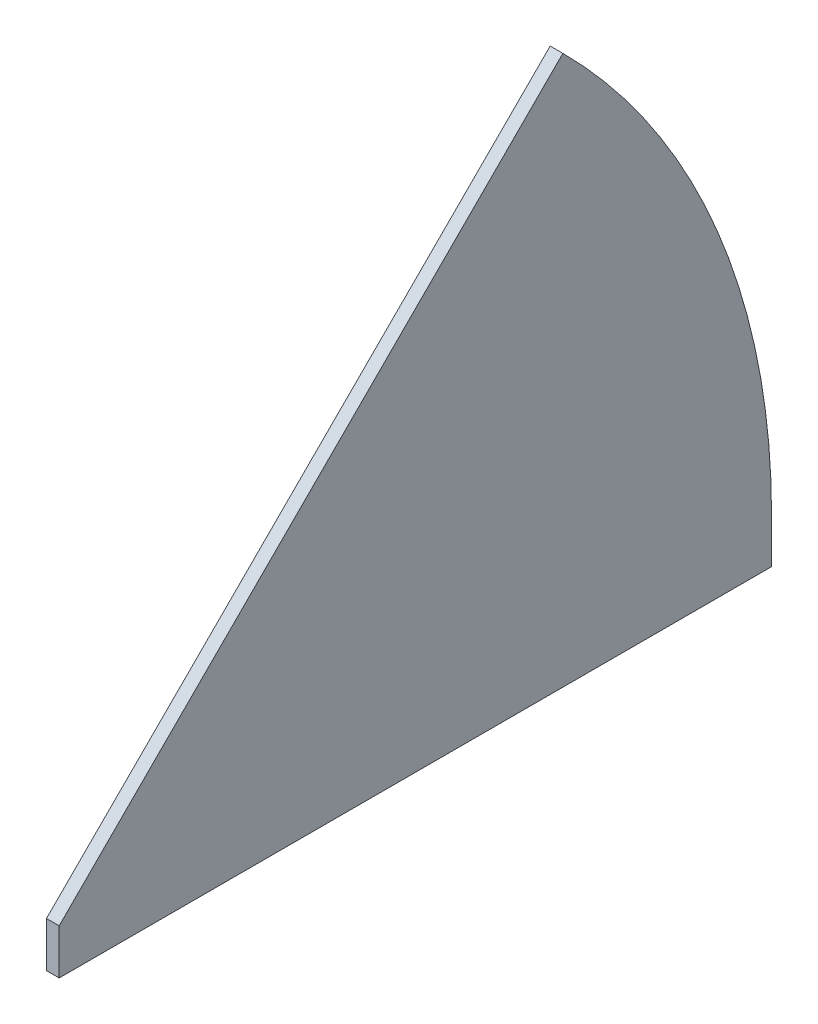
ISO-10303-21;
HEADER;
FILE_DESCRIPTION(('STEP AP214'),'2;1');
FILE_NAME('part.step','',(''),(''),'','','');
FILE_SCHEMA(('AUTOMOTIVE_DESIGN { 1 0 10303 214 1 1 1 1 }'));
ENDSEC;
DATA;
#1=APPLICATION_CONTEXT('core data for automotive mechanical design processes');
#2=APPLICATION_PROTOCOL_DEFINITION('international standard','automotive_design',2000,#1);
#3=PRODUCT_CONTEXT('',#1,'mechanical');
#4=PRODUCT('Part','Part','',(#3));
#5=PRODUCT_RELATED_PRODUCT_CATEGORY('part','',(#4));
#6=PRODUCT_DEFINITION_FORMATION('','',#4);
#7=PRODUCT_DEFINITION_CONTEXT('part definition',#1,'design');
#8=PRODUCT_DEFINITION('design','',#6,#7);
#9=PRODUCT_DEFINITION_SHAPE('','',#8);
#10=(LENGTH_UNIT() NAMED_UNIT(*) SI_UNIT(.MILLI.,.METRE.));
#11=(NAMED_UNIT(*) PLANE_ANGLE_UNIT() SI_UNIT($,.RADIAN.));
#12=(NAMED_UNIT(*) SI_UNIT($,.STERADIAN.) SOLID_ANGLE_UNIT());
#13=UNCERTAINTY_MEASURE_WITH_UNIT(LENGTH_MEASURE(1.E-05),#10,'distance_accuracy_value','');
#14=(GEOMETRIC_REPRESENTATION_CONTEXT(3) GLOBAL_UNCERTAINTY_ASSIGNED_CONTEXT((#13)) GLOBAL_UNIT_ASSIGNED_CONTEXT((#10,
#11,#12)) REPRESENTATION_CONTEXT('',''));
#15=CARTESIAN_POINT('',(0.,0.,0.));
#16=DIRECTION('',(0.,0.,1.));
#17=DIRECTION('',(1.,0.,0.));
#18=AXIS2_PLACEMENT_3D('',#15,#16,#17);
#19=CARTESIAN_POINT('',(3.175,0.,0.));
#20=DIRECTION('',(0.,-0.707106781186546,-0.707106781186549));
#21=DIRECTION('',(0.,0.707106781186549,-0.707106781186546));
#22=AXIS2_PLACEMENT_3D('',#19,#20,#21);
#23=PLANE('',#22);
#24=DIRECTION('',(0.,-0.707106781186549,0.707106781186546));
#25=VECTOR('',#24,1.);
#26=CARTESIAN_POINT('',(0.,0.,0.));
#27=LINE('',#26,#25);
#28=CARTESIAN_POINT('',(0.,125.90319081739,-125.903190817389));
#29=VERTEX_POINT('',#28);
#30=CARTESIAN_POINT('',(0.,0.,0.));
#31=VERTEX_POINT('',#30);
#32=EDGE_CURVE('E90',#29,#31,#27,.T.);
#33=ORIENTED_EDGE('',*,*,#32,.T.);
#34=DIRECTION('',(-1.,0.,0.));
#35=VECTOR('',#34,1.);
#36=CARTESIAN_POINT('',(3.175,0.,0.));
#37=LINE('',#36,#35);
#38=CARTESIAN_POINT('',(3.175,0.,0.));
#39=VERTEX_POINT('',#38);
#40=EDGE_CURVE('E11',#39,#31,#37,.T.);
#41=ORIENTED_EDGE('',*,*,#40,.F.);
#42=DIRECTION('',(0.,-0.707106781186549,0.707106781186546));
#43=VECTOR('',#42,1.);
#44=CARTESIAN_POINT('',(3.175,0.,0.));
#45=LINE('',#44,#43);
#46=CARTESIAN_POINT('',(3.175,125.90319081739,-125.903190817389));
#47=VERTEX_POINT('',#46);
#48=EDGE_CURVE('E79',#47,#39,#45,.T.);
#49=ORIENTED_EDGE('',*,*,#48,.F.);
#50=DIRECTION('',(-1.,0.,0.));
#51=VECTOR('',#50,1.);
#52=CARTESIAN_POINT('',(3.175,125.90319081739,-125.903190817389));
#53=LINE('',#52,#51);
#54=EDGE_CURVE('E105',#47,#29,#53,.T.);
#55=ORIENTED_EDGE('',*,*,#54,.T.);
#56=EDGE_LOOP('',(#33,#41,#49,#55));
#57=FACE_BOUND('',#56,.T.);
#58=ADVANCED_FACE('F33',(#57),#23,.F.);
#59=CARTESIAN_POINT('',(3.175,0.,0.));
#60=DIRECTION('',(-1.,0.,0.));
#61=DIRECTION('',(0.,0.,1.));
#62=AXIS2_PLACEMENT_3D('',#59,#60,#61);
#63=CYLINDRICAL_SURFACE('',#62,178.054);
#64=CARTESIAN_POINT('',(0.,0.,0.));
#65=DIRECTION('',(1.,0.,0.));
#66=DIRECTION('',(0.,0.,-1.));
#67=AXIS2_PLACEMENT_3D('',#64,#65,#66);
#68=CIRCLE('',#67,178.054);
#69=CARTESIAN_POINT('',(0.,0.,-178.054));
#70=VERTEX_POINT('',#69);
#71=EDGE_CURVE('E87',#70,#29,#68,.T.);
#72=ORIENTED_EDGE('',*,*,#71,.T.);
#73=ORIENTED_EDGE('',*,*,#54,.F.);
#74=CARTESIAN_POINT('',(3.175,0.,0.));
#75=DIRECTION('',(1.,0.,0.));
#76=DIRECTION('',(0.,0.,-1.));
#77=AXIS2_PLACEMENT_3D('',#74,#75,#76);
#78=CIRCLE('',#77,178.054);
#79=CARTESIAN_POINT('',(3.175,0.,-178.054));
#80=VERTEX_POINT('',#79);
#81=EDGE_CURVE('E49',#80,#47,#78,.T.);
#82=ORIENTED_EDGE('',*,*,#81,.F.);
#83=DIRECTION('',(-1.,0.,0.));
#84=VECTOR('',#83,1.);
#85=CARTESIAN_POINT('',(3.175,0.,-178.054));
#86=LINE('',#85,#84);
#87=EDGE_CURVE('E41',#80,#70,#86,.T.);
#88=ORIENTED_EDGE('',*,*,#87,.T.);
#89=EDGE_LOOP('',(#72,#73,#82,#88));
#90=FACE_BOUND('',#89,.T.);
#91=ADVANCED_FACE('F135',(#90),#63,.T.);
#92=CARTESIAN_POINT('',(3.175,0.,0.));
#93=DIRECTION('',(1.,0.,0.));
#94=DIRECTION('',(0.,0.,-1.));
#95=AXIS2_PLACEMENT_3D('',#92,#93,#94);
#96=PLANE('',#95);
#97=ORIENTED_EDGE('',*,*,#48,.T.);
#98=DIRECTION('',(0.,1.,0.));
#99=VECTOR('',#98,1.);
#100=CARTESIAN_POINT('',(3.175,-11.303,0.));
#101=LINE('',#100,#99);
#102=CARTESIAN_POINT('',(3.175,-11.303,0.));
#103=VERTEX_POINT('',#102);
#104=EDGE_CURVE('E84',#103,#39,#101,.T.);
#105=ORIENTED_EDGE('',*,*,#104,.F.);
#106=DIRECTION('',(0.,0.,1.));
#107=VECTOR('',#106,1.);
#108=CARTESIAN_POINT('',(3.175,-11.303,-178.054));
#109=LINE('',#108,#107);
#110=CARTESIAN_POINT('',(3.175,-11.303,-178.054));
#111=VERTEX_POINT('',#110);
#112=EDGE_CURVE('E116',#111,#103,#109,.T.);
#113=ORIENTED_EDGE('',*,*,#112,.F.);
#114=DIRECTION('',(0.,1.,0.));
#115=VECTOR('',#114,1.);
#116=CARTESIAN_POINT('',(3.175,-11.303,-178.054));
#117=LINE('',#116,#115);
#118=EDGE_CURVE('E94',#111,#80,#117,.T.);
#119=ORIENTED_EDGE('',*,*,#118,.T.);
#120=ORIENTED_EDGE('',*,*,#81,.T.);
#121=EDGE_LOOP('',(#97,#105,#113,#119,#120));
#122=FACE_BOUND('',#121,.T.);
#123=ADVANCED_FACE('F81',(#122),#96,.T.);
#124=CARTESIAN_POINT('',(0.,0.,0.));
#125=DIRECTION('',(1.,0.,0.));
#126=DIRECTION('',(0.,0.,-1.));
#127=AXIS2_PLACEMENT_3D('',#124,#125,#126);
#128=PLANE('',#127);
#129=ORIENTED_EDGE('',*,*,#32,.F.);
#130=ORIENTED_EDGE('',*,*,#71,.F.);
#131=DIRECTION('',(0.,1.,0.));
#132=VECTOR('',#131,1.);
#133=CARTESIAN_POINT('',(0.,-11.303,-178.054));
#134=LINE('',#133,#132);
#135=CARTESIAN_POINT('',(0.,-11.303,-178.054));
#136=VERTEX_POINT('',#135);
#137=EDGE_CURVE('E97',#136,#70,#134,.T.);
#138=ORIENTED_EDGE('',*,*,#137,.F.);
#139=DIRECTION('',(0.,0.,-1.));
#140=VECTOR('',#139,1.);
#141=CARTESIAN_POINT('',(0.,-11.303,-178.054));
#142=LINE('',#141,#140);
#143=CARTESIAN_POINT('',(0.,-11.303,0.));
#144=VERTEX_POINT('',#143);
#145=EDGE_CURVE('E112',#144,#136,#142,.T.);
#146=ORIENTED_EDGE('',*,*,#145,.F.);
#147=DIRECTION('',(0.,1.,0.));
#148=VECTOR('',#147,1.);
#149=CARTESIAN_POINT('',(0.,-11.303,0.));
#150=LINE('',#149,#148);
#151=EDGE_CURVE('E95',#144,#31,#150,.T.);
#152=ORIENTED_EDGE('',*,*,#151,.T.);
#153=EDGE_LOOP('',(#129,#130,#138,#146,#152));
#154=FACE_BOUND('',#153,.T.);
#155=ADVANCED_FACE('F109',(#154),#128,.F.);
#156=CARTESIAN_POINT('',(0.,-11.303,-178.054));
#157=DIRECTION('',(0.,0.,1.));
#158=DIRECTION('',(1.,0.,0.));
#159=AXIS2_PLACEMENT_3D('',#156,#157,#158);
#160=PLANE('',#159);
#161=ORIENTED_EDGE('',*,*,#87,.F.);
#162=ORIENTED_EDGE('',*,*,#118,.F.);
#163=DIRECTION('',(1.,0.,0.));
#164=VECTOR('',#163,1.);
#165=CARTESIAN_POINT('',(0.,-11.303,-178.054));
#166=LINE('',#165,#164);
#167=EDGE_CURVE('E114',#136,#111,#166,.T.);
#168=ORIENTED_EDGE('',*,*,#167,.F.);
#169=ORIENTED_EDGE('',*,*,#137,.T.);
#170=EDGE_LOOP('',(#161,#162,#168,#169));
#171=FACE_BOUND('',#170,.T.);
#172=ADVANCED_FACE('F124',(#171),#160,.F.);
#173=CARTESIAN_POINT('',(0.,-11.303,0.));
#174=DIRECTION('',(0.,0.,-1.));
#175=DIRECTION('',(-1.,0.,0.));
#176=AXIS2_PLACEMENT_3D('',#173,#174,#175);
#177=PLANE('',#176);
#178=ORIENTED_EDGE('',*,*,#40,.T.);
#179=ORIENTED_EDGE('',*,*,#151,.F.);
#180=DIRECTION('',(-1.,0.,0.));
#181=VECTOR('',#180,1.);
#182=CARTESIAN_POINT('',(0.,-11.303,0.));
#183=LINE('',#182,#181);
#184=EDGE_CURVE('E68',#103,#144,#183,.T.);
#185=ORIENTED_EDGE('',*,*,#184,.F.);
#186=ORIENTED_EDGE('',*,*,#104,.T.);
#187=EDGE_LOOP('',(#178,#179,#185,#186));
#188=FACE_BOUND('',#187,.T.);
#189=ADVANCED_FACE('F93',(#188),#177,.F.);
#190=CARTESIAN_POINT('',(0.,-11.303,0.));
#191=DIRECTION('',(0.,1.,0.));
#192=DIRECTION('',(0.,0.,1.));
#193=AXIS2_PLACEMENT_3D('',#190,#191,#192);
#194=PLANE('',#193);
#195=ORIENTED_EDGE('',*,*,#145,.T.);
#196=ORIENTED_EDGE('',*,*,#167,.T.);
#197=ORIENTED_EDGE('',*,*,#112,.T.);
#198=ORIENTED_EDGE('',*,*,#184,.T.);
#199=EDGE_LOOP('',(#195,#196,#197,#198));
#200=FACE_BOUND('',#199,.T.);
#201=ADVANCED_FACE('F119',(#200),#194,.F.);
#202=CLOSED_SHELL('',(#58,#91,#123,#155,#172,#189,#201));
#203=MANIFOLD_SOLID_BREP('B2',#202);
#204=ADVANCED_BREP_SHAPE_REPRESENTATION('',(#18,#203),#14);
#205=SHAPE_DEFINITION_REPRESENTATION(#9,#204);
ENDSEC;
END-ISO-10303-21;
